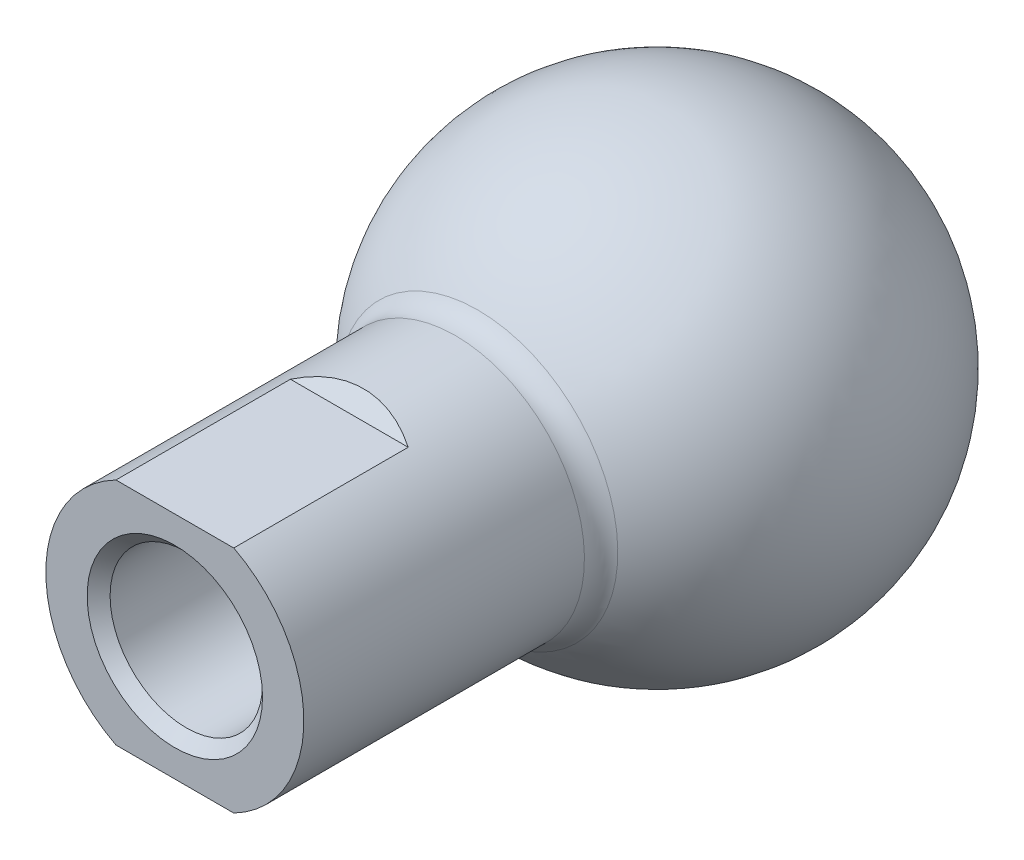
ISO-10303-21;
HEADER;
FILE_DESCRIPTION(('STEP AP214'),'2;1');
FILE_NAME('part.step','',(''),(''),'','','');
FILE_SCHEMA(('AUTOMOTIVE_DESIGN { 1 0 10303 214 1 1 1 1 }'));
ENDSEC;
DATA;
#1=APPLICATION_CONTEXT('core data for automotive mechanical design processes');
#2=APPLICATION_PROTOCOL_DEFINITION('international standard','automotive_design',2000,#1);
#3=PRODUCT_CONTEXT('',#1,'mechanical');
#4=PRODUCT('Part','Part','',(#3));
#5=PRODUCT_RELATED_PRODUCT_CATEGORY('part','',(#4));
#6=PRODUCT_DEFINITION_FORMATION('','',#4);
#7=PRODUCT_DEFINITION_CONTEXT('part definition',#1,'design');
#8=PRODUCT_DEFINITION('design','',#6,#7);
#9=PRODUCT_DEFINITION_SHAPE('','',#8);
#10=(LENGTH_UNIT() NAMED_UNIT(*) SI_UNIT(.MILLI.,.METRE.));
#11=(NAMED_UNIT(*) PLANE_ANGLE_UNIT() SI_UNIT($,.RADIAN.));
#12=(NAMED_UNIT(*) SI_UNIT($,.STERADIAN.) SOLID_ANGLE_UNIT());
#13=UNCERTAINTY_MEASURE_WITH_UNIT(LENGTH_MEASURE(1.E-05),#10,'distance_accuracy_value','');
#14=(GEOMETRIC_REPRESENTATION_CONTEXT(3) GLOBAL_UNCERTAINTY_ASSIGNED_CONTEXT((#13)) GLOBAL_UNIT_ASSIGNED_CONTEXT((#10,
#11,#12)) REPRESENTATION_CONTEXT('',''));
#15=CARTESIAN_POINT('',(0.,0.,0.));
#16=DIRECTION('',(0.,0.,1.));
#17=DIRECTION('',(1.,0.,0.));
#18=AXIS2_PLACEMENT_3D('',#15,#16,#17);
#19=CARTESIAN_POINT('',(0.,0.,-28.575));
#20=DIRECTION('',(0.,0.,1.));
#21=DIRECTION('',(1.,0.,0.));
#22=AXIS2_PLACEMENT_3D('',#19,#20,#21);
#23=PLANE('',#22);
#24=CARTESIAN_POINT('',(0.,0.,-28.5749999999894));
#25=DIRECTION('',(0.,0.,-1.));
#26=DIRECTION('',(-1.,0.,0.));
#27=AXIS2_PLACEMENT_3D('',#24,#25,#26);
#28=CIRCLE('',#27,2.57809999999381);
#29=CARTESIAN_POINT('',(-2.57809999999381,0.,-28.5749999999894));
#30=VERTEX_POINT('',#29);
#31=EDGE_CURVE('E136',#30,#30,#28,.T.);
#32=ORIENTED_EDGE('',*,*,#31,.F.);
#33=EDGE_LOOP('',(#32));
#34=FACE_BOUND('',#33,.T.);
#35=ADVANCED_FACE('F14',(#34),#23,.T.);
#36=CARTESIAN_POINT('',(0.,0.,-33.3502));
#37=DIRECTION('',(0.,0.,-1.));
#38=DIRECTION('',(-1.,0.,0.));
#39=AXIS2_PLACEMENT_3D('',#36,#37,#38);
#40=PLANE('',#39);
#41=DIRECTION('',(0.500000000000017,0.866025403784429,0.));
#42=VECTOR('',#41,1.);
#43=CARTESIAN_POINT('',(2.7422983085979,0.,-33.3502));
#44=LINE('',#43,#42);
#45=CARTESIAN_POINT('',(2.74229830859754,-2.06720328100224E-13,-33.3502));
#46=VERTEX_POINT('',#45);
#47=CARTESIAN_POINT('',(1.37114915429862,-2.3749000000001,-33.3502));
#48=VERTEX_POINT('',#47);
#49=EDGE_CURVE('E219',#46,#48,#44,.F.);
#50=ORIENTED_EDGE('',*,*,#49,.T.);
#51=DIRECTION('',(1.,0.,0.));
#52=VECTOR('',#51,1.);
#53=CARTESIAN_POINT('',(1.37114915429844,-2.3749,-33.3502));
#54=LINE('',#53,#52);
#55=CARTESIAN_POINT('',(-1.37114915429844,-2.3749,-33.3502));
#56=VERTEX_POINT('',#55);
#57=EDGE_CURVE('E138',#48,#56,#54,.F.);
#58=ORIENTED_EDGE('',*,*,#57,.T.);
#59=DIRECTION('',(0.500000000000017,-0.866025403784429,0.));
#60=VECTOR('',#59,1.);
#61=CARTESIAN_POINT('',(-1.37114915429844,-2.3749,-33.3502));
#62=LINE('',#61,#60);
#63=CARTESIAN_POINT('',(-2.74229830859754,2.06720328100224E-13,-33.3502));
#64=VERTEX_POINT('',#63);
#65=EDGE_CURVE('E146',#56,#64,#62,.F.);
#66=ORIENTED_EDGE('',*,*,#65,.T.);
#67=DIRECTION('',(-0.500000000000017,-0.866025403784429,0.));
#68=VECTOR('',#67,1.);
#69=CARTESIAN_POINT('',(-2.7422983085979,0.,-33.3502));
#70=LINE('',#69,#68);
#71=CARTESIAN_POINT('',(-1.3711491542988,2.37490000000021,-33.3502));
#72=VERTEX_POINT('',#71);
#73=EDGE_CURVE('E234',#64,#72,#70,.F.);
#74=ORIENTED_EDGE('',*,*,#73,.T.);
#75=DIRECTION('',(1.,0.,0.));
#76=VECTOR('',#75,1.);
#77=CARTESIAN_POINT('',(-1.37114915429844,2.3749,-33.3502));
#78=LINE('',#77,#76);
#79=CARTESIAN_POINT('',(1.37114915429844,2.3749,-33.3502));
#80=VERTEX_POINT('',#79);
#81=EDGE_CURVE('E229',#72,#80,#78,.T.);
#82=ORIENTED_EDGE('',*,*,#81,.T.);
#83=DIRECTION('',(-0.500000000000017,0.866025403784429,0.));
#84=VECTOR('',#83,1.);
#85=CARTESIAN_POINT('',(1.37114915429844,2.3749,-33.3502));
#86=LINE('',#85,#84);
#87=EDGE_CURVE('E224',#80,#46,#86,.F.);
#88=ORIENTED_EDGE('',*,*,#87,.T.);
#89=EDGE_LOOP('',(#50,#58,#66,#74,#82,#88));
#90=FACE_BOUND('',#89,.T.);
#91=ADVANCED_FACE('F239',(#90),#40,.T.);
#92=CARTESIAN_POINT('',(0.,0.,-30.2132999999003));
#93=DIRECTION('',(0.,0.,-1.));
#94=DIRECTION('',(-1.,0.,0.));
#95=AXIS2_PLACEMENT_3D('',#92,#93,#94);
#96=CONICAL_SURFACE('',#95,4.21639999990475,0.785398163397448);
#97=ORIENTED_EDGE('',*,*,#31,.T.);
#98=EDGE_LOOP('',(#97));
#99=FACE_BOUND('',#98,.T.);
#100=CARTESIAN_POINT('',(0.,3.11060286983338E-13,-30.2133));
#101=DIRECTION('',(0.,0.,-1.));
#102=DIRECTION('',(-1.,0.,0.));
#103=AXIS2_PLACEMENT_3D('',#100,#101,#102);
#104=CIRCLE('',#103,4.2164);
#105=CARTESIAN_POINT('',(-4.2164,3.11060286983338E-13,-30.2133));
#106=VERTEX_POINT('',#105);
#107=EDGE_CURVE('E150',#106,#106,#104,.F.);
#108=ORIENTED_EDGE('',*,*,#107,.T.);
#109=EDGE_LOOP('',(#108));
#110=FACE_BOUND('',#109,.T.);
#111=ADVANCED_FACE('F329',(#99,#110),#96,.T.);
#112=CARTESIAN_POINT('',(1.37114915429844,-2.3749,-38.1));
#113=DIRECTION('',(0.,-1.,0.));
#114=DIRECTION('',(0.,0.,-1.));
#115=AXIS2_PLACEMENT_3D('',#112,#113,#114);
#116=PLANE('',#115);
#117=ORIENTED_EDGE('',*,*,#57,.F.);
#118=DIRECTION('',(0.,0.,1.));
#119=VECTOR('',#118,1.);
#120=CARTESIAN_POINT('',(1.37114915429916,-2.37490000000041,-38.1));
#121=LINE('',#120,#119);
#122=CARTESIAN_POINT('',(1.37114915429862,-2.3749000000001,-38.1));
#123=VERTEX_POINT('',#122);
#124=EDGE_CURVE('E154',#48,#123,#121,.F.);
#125=ORIENTED_EDGE('',*,*,#124,.T.);
#126=DIRECTION('',(1.,0.,0.));
#127=VECTOR('',#126,1.);
#128=CARTESIAN_POINT('',(0.,-2.3749,-38.1));
#129=LINE('',#128,#127);
#130=CARTESIAN_POINT('',(-1.37114915429844,-2.3749,-38.1));
#131=VERTEX_POINT('',#130);
#132=EDGE_CURVE('E153',#123,#131,#129,.F.);
#133=ORIENTED_EDGE('',*,*,#132,.T.);
#134=DIRECTION('',(0.,0.,1.));
#135=VECTOR('',#134,1.);
#136=CARTESIAN_POINT('',(-1.37114915429844,-2.3749,-38.1));
#137=LINE('',#136,#135);
#138=EDGE_CURVE('E141',#131,#56,#137,.T.);
#139=ORIENTED_EDGE('',*,*,#138,.T.);
#140=EDGE_LOOP('',(#117,#125,#133,#139));
#141=FACE_BOUND('',#140,.T.);
#142=ADVANCED_FACE('F267',(#141),#116,.F.);
#143=CARTESIAN_POINT('',(-1.37114915429844,-2.3749,-38.1));
#144=DIRECTION('',(-0.866025403784429,-0.500000000000017,0.));
#145=DIRECTION('',(0.500000000000017,-0.866025403784429,0.));
#146=AXIS2_PLACEMENT_3D('',#143,#144,#145);
#147=PLANE('',#146);
#148=ORIENTED_EDGE('',*,*,#65,.F.);
#149=ORIENTED_EDGE('',*,*,#138,.F.);
#150=DIRECTION('',(-0.500000000000278,0.866025403784278,0.));
#151=VECTOR('',#150,1.);
#152=CARTESIAN_POINT('',(-1.37114915429844,-2.3749,-38.1));
#153=LINE('',#152,#151);
#154=CARTESIAN_POINT('',(-2.74229830859754,2.06720328100224E-13,-38.1));
#155=VERTEX_POINT('',#154);
#156=EDGE_CURVE('E215',#131,#155,#153,.T.);
#157=ORIENTED_EDGE('',*,*,#156,.T.);
#158=DIRECTION('',(0.,0.,1.));
#159=VECTOR('',#158,1.);
#160=CARTESIAN_POINT('',(-2.7422983085979,0.,-38.1));
#161=LINE('',#160,#159);
#162=EDGE_CURVE('E236',#155,#64,#161,.T.);
#163=ORIENTED_EDGE('',*,*,#162,.T.);
#164=EDGE_LOOP('',(#148,#149,#157,#163));
#165=FACE_BOUND('',#164,.T.);
#166=ADVANCED_FACE('F244',(#165),#147,.F.);
#167=CARTESIAN_POINT('',(-2.7422983085979,0.,-38.1));
#168=DIRECTION('',(-0.866025403784429,0.500000000000017,0.));
#169=DIRECTION('',(-0.500000000000017,-0.866025403784429,0.));
#170=AXIS2_PLACEMENT_3D('',#167,#168,#169);
#171=PLANE('',#170);
#172=ORIENTED_EDGE('',*,*,#73,.F.);
#173=ORIENTED_EDGE('',*,*,#162,.F.);
#174=DIRECTION('',(0.500000000000278,0.866025403784278,0.));
#175=VECTOR('',#174,1.);
#176=CARTESIAN_POINT('',(-2.7422983085979,0.,-38.1));
#177=LINE('',#176,#175);
#178=CARTESIAN_POINT('',(-1.3711491542988,2.37490000000021,-38.1));
#179=VERTEX_POINT('',#178);
#180=EDGE_CURVE('E213',#155,#179,#177,.T.);
#181=ORIENTED_EDGE('',*,*,#180,.T.);
#182=DIRECTION('',(0.,0.,1.));
#183=VECTOR('',#182,1.);
#184=CARTESIAN_POINT('',(-1.37114915429844,2.3749,-38.1));
#185=LINE('',#184,#183);
#186=EDGE_CURVE('E231',#179,#72,#185,.T.);
#187=ORIENTED_EDGE('',*,*,#186,.T.);
#188=EDGE_LOOP('',(#172,#173,#181,#187));
#189=FACE_BOUND('',#188,.T.);
#190=ADVANCED_FACE('F248',(#189),#171,.F.);
#191=CARTESIAN_POINT('',(-1.37114915429844,2.3749,-38.1));
#192=DIRECTION('',(0.,1.,0.));
#193=DIRECTION('',(0.,0.,1.));
#194=AXIS2_PLACEMENT_3D('',#191,#192,#193);
#195=PLANE('',#194);
#196=ORIENTED_EDGE('',*,*,#81,.F.);
#197=ORIENTED_EDGE('',*,*,#186,.F.);
#198=DIRECTION('',(1.,0.,0.));
#199=VECTOR('',#198,1.);
#200=CARTESIAN_POINT('',(0.,2.3749,-38.1));
#201=LINE('',#200,#199);
#202=CARTESIAN_POINT('',(1.37114915429844,2.3749,-38.1));
#203=VERTEX_POINT('',#202);
#204=EDGE_CURVE('E211',#179,#203,#201,.T.);
#205=ORIENTED_EDGE('',*,*,#204,.T.);
#206=DIRECTION('',(0.,0.,1.));
#207=VECTOR('',#206,1.);
#208=CARTESIAN_POINT('',(1.37114915429844,2.3749,-38.1));
#209=LINE('',#208,#207);
#210=EDGE_CURVE('E226',#203,#80,#209,.T.);
#211=ORIENTED_EDGE('',*,*,#210,.T.);
#212=EDGE_LOOP('',(#196,#197,#205,#211));
#213=FACE_BOUND('',#212,.T.);
#214=ADVANCED_FACE('F253',(#213),#195,.F.);
#215=CARTESIAN_POINT('',(1.37114915429844,2.3749,-38.1));
#216=DIRECTION('',(0.866025403784429,0.500000000000017,0.));
#217=DIRECTION('',(-0.500000000000017,0.866025403784429,0.));
#218=AXIS2_PLACEMENT_3D('',#215,#216,#217);
#219=PLANE('',#218);
#220=ORIENTED_EDGE('',*,*,#87,.F.);
#221=ORIENTED_EDGE('',*,*,#210,.F.);
#222=DIRECTION('',(0.500000000000278,-0.866025403784278,0.));
#223=VECTOR('',#222,1.);
#224=CARTESIAN_POINT('',(1.37114915429844,2.3749,-38.1));
#225=LINE('',#224,#223);
#226=CARTESIAN_POINT('',(2.74229830859754,-2.06720328100224E-13,-38.1));
#227=VERTEX_POINT('',#226);
#228=EDGE_CURVE('E209',#203,#227,#225,.T.);
#229=ORIENTED_EDGE('',*,*,#228,.T.);
#230=DIRECTION('',(0.,0.,1.));
#231=VECTOR('',#230,1.);
#232=CARTESIAN_POINT('',(2.7422983085979,0.,-38.1));
#233=LINE('',#232,#231);
#234=EDGE_CURVE('E221',#227,#46,#233,.T.);
#235=ORIENTED_EDGE('',*,*,#234,.T.);
#236=EDGE_LOOP('',(#220,#221,#229,#235));
#237=FACE_BOUND('',#236,.T.);
#238=ADVANCED_FACE('F259',(#237),#219,.F.);
#239=CARTESIAN_POINT('',(2.7422983085979,0.,-38.1));
#240=DIRECTION('',(0.866025403784429,-0.500000000000017,0.));
#241=DIRECTION('',(0.500000000000017,0.866025403784429,0.));
#242=AXIS2_PLACEMENT_3D('',#239,#240,#241);
#243=PLANE('',#242);
#244=ORIENTED_EDGE('',*,*,#49,.F.);
#245=ORIENTED_EDGE('',*,*,#234,.F.);
#246=DIRECTION('',(-0.500000000000278,-0.866025403784278,0.));
#247=VECTOR('',#246,1.);
#248=CARTESIAN_POINT('',(2.7422983085979,0.,-38.1));
#249=LINE('',#248,#247);
#250=EDGE_CURVE('E135',#227,#123,#249,.T.);
#251=ORIENTED_EDGE('',*,*,#250,.T.);
#252=ORIENTED_EDGE('',*,*,#124,.F.);
#253=EDGE_LOOP('',(#244,#245,#251,#252));
#254=FACE_BOUND('',#253,.T.);
#255=ADVANCED_FACE('F264',(#254),#243,.F.);
#256=CARTESIAN_POINT('',(0.,3.11060286983338E-13,0.));
#257=DIRECTION('',(0.,0.,-1.));
#258=DIRECTION('',(-1.,0.,0.));
#259=AXIS2_PLACEMENT_3D('',#256,#257,#258);
#260=CYLINDRICAL_SURFACE('',#259,4.2164);
#261=CARTESIAN_POINT('',(0.,3.13117587413814E-13,-0.634961470139129));
#262=DIRECTION('',(0.,0.,1.));
#263=DIRECTION('',(1.,0.,0.));
#264=AXIS2_PLACEMENT_3D('',#261,#262,#263);
#265=CIRCLE('',#264,4.2164);
#266=CARTESIAN_POINT('',(4.2164,3.13117587413814E-13,-0.634961470139129));
#267=VERTEX_POINT('',#266);
#268=EDGE_CURVE('E132',#267,#267,#265,.T.);
#269=ORIENTED_EDGE('',*,*,#268,.T.);
#270=EDGE_LOOP('',(#269));
#271=FACE_BOUND('',#270,.T.);
#272=ORIENTED_EDGE('',*,*,#107,.F.);
#273=EDGE_LOOP('',(#272));
#274=FACE_BOUND('',#273,.T.);
#275=ADVANCED_FACE('F273',(#271,#274),#260,.F.);
#276=CARTESIAN_POINT('',(0.,0.,-38.1));
#277=DIRECTION('',(0.,0.,1.));
#278=DIRECTION('',(1.,0.,0.));
#279=AXIS2_PLACEMENT_3D('',#276,#277,#278);
#280=PLANE('',#279);
#281=ORIENTED_EDGE('',*,*,#228,.F.);
#282=ORIENTED_EDGE('',*,*,#204,.F.);
#283=ORIENTED_EDGE('',*,*,#180,.F.);
#284=ORIENTED_EDGE('',*,*,#156,.F.);
#285=ORIENTED_EDGE('',*,*,#132,.F.);
#286=ORIENTED_EDGE('',*,*,#250,.F.);
#287=EDGE_LOOP('',(#281,#282,#283,#284,#285,#286));
#288=FACE_BOUND('',#287,.T.);
#289=CARTESIAN_POINT('',(0.,0.,-38.0999999999858));
#290=DIRECTION('',(0.,0.,1.));
#291=DIRECTION('',(1.,0.,0.));
#292=AXIS2_PLACEMENT_3D('',#289,#290,#291);
#293=CIRCLE('',#292,4.00050000001784);
#294=CARTESIAN_POINT('',(4.00050000001784,0.,-38.0999999999858));
#295=VERTEX_POINT('',#294);
#296=EDGE_CURVE('E129',#295,#295,#293,.T.);
#297=ORIENTED_EDGE('',*,*,#296,.F.);
#298=EDGE_LOOP('',(#297));
#299=FACE_BOUND('',#298,.T.);
#300=ADVANCED_FACE('F269',(#288,#299),#280,.F.);
#301=CARTESIAN_POINT('',(0.,3.13117587413814E-13,1.87033037946094E-05));
#302=DIRECTION('',(0.,0.,1.));
#303=DIRECTION('',(1.,0.,0.));
#304=AXIS2_PLACEMENT_3D('',#301,#302,#303);
#305=CONICAL_SURFACE('',#304,4.85137437095804,0.78539359434818);
#306=ORIENTED_EDGE('',*,*,#268,.F.);
#307=EDGE_LOOP('',(#306));
#308=FACE_BOUND('',#307,.T.);
#309=CARTESIAN_POINT('',(0.,3.13117587413814E-13,0.));
#310=DIRECTION('',(0.,0.,1.));
#311=DIRECTION('',(1.,0.,0.));
#312=AXIS2_PLACEMENT_3D('',#309,#310,#311);
#313=CIRCLE('',#312,4.85135566782516);
#314=CARTESIAN_POINT('',(4.85135566782516,3.13117587413814E-13,0.));
#315=VERTEX_POINT('',#314);
#316=EDGE_CURVE('E105',#315,#315,#313,.F.);
#317=ORIENTED_EDGE('',*,*,#316,.F.);
#318=EDGE_LOOP('',(#317));
#319=FACE_BOUND('',#318,.T.);
#320=ADVANCED_FACE('F272',(#308,#319),#305,.F.);
#321=CARTESIAN_POINT('',(0.,0.,-37.6745702222934));
#322=DIRECTION('',(0.,0.,1.));
#323=DIRECTION('',(1.,0.,0.));
#324=AXIS2_PLACEMENT_3D('',#321,#322,#323);
#325=CONICAL_SURFACE('',#324,4.42592977765344,0.785398163330641);
#326=ORIENTED_EDGE('',*,*,#296,.T.);
#327=EDGE_LOOP('',(#326));
#328=FACE_BOUND('',#327,.T.);
#329=CARTESIAN_POINT('',(0.,3.09980732084794E-13,-37.6745702223502));
#330=DIRECTION('',(0.,0.,-1.));
#331=DIRECTION('',(0.,-1.,0.));
#332=AXIS2_PLACEMENT_3D('',#329,#330,#331);
#333=CIRCLE('',#332,4.42592977771059);
#334=CARTESIAN_POINT('',(0.,-4.42592977771028,-37.6745702223502));
#335=VERTEX_POINT('',#334);
#336=EDGE_CURVE('E200',#335,#335,#333,.T.);
#337=ORIENTED_EDGE('',*,*,#336,.T.);
#338=EDGE_LOOP('',(#337));
#339=FACE_BOUND('',#338,.T.);
#340=ADVANCED_FACE('F277',(#328,#339),#325,.T.);
#341=CARTESIAN_POINT('',(-15.0876,6.35,-9.652));
#342=DIRECTION('',(0.,-0.707106781186548,-0.707106781186548));
#343=DIRECTION('',(0.,0.707106781186548,-0.707106781186548));
#344=AXIS2_PLACEMENT_3D('',#341,#342,#343);
#345=PLANE('',#344);
#346=DIRECTION('',(1.,0.,0.));
#347=VECTOR('',#346,1.);
#348=CARTESIAN_POINT('',(-15.0876,6.35,-9.652));
#349=LINE('',#348,#347);
#350=CARTESIAN_POINT('',(-3.25883088852507,6.34999999999991,-9.65199999999991));
#351=VERTEX_POINT('',#350);
#352=CARTESIAN_POINT('',(3.25883088852506,6.34999999999991,-9.65199999999991));
#353=VERTEX_POINT('',#352);
#354=EDGE_CURVE('E121',#351,#353,#349,.T.);
#355=ORIENTED_EDGE('',*,*,#354,.T.);
#356=CARTESIAN_POINT('',(0.,3.06161087463494E-13,-3.3020000000003));
#357=DIRECTION('',(0.,-0.707106781186548,-0.707106781186548));
#358=DIRECTION('',(0.,-0.707106781186548,0.707106781186548));
#359=AXIS2_PLACEMENT_3D('',#356,#357,#358);
#360=ELLIPSE('',#359,10.0938078800817,7.1374);
#361=EDGE_CURVE('E125',#351,#353,#360,.T.);
#362=ORIENTED_EDGE('',*,*,#361,.F.);
#363=EDGE_LOOP('',(#355,#362));
#364=FACE_BOUND('',#363,.T.);
#365=ADVANCED_FACE('F280',(#364),#345,.F.);
#366=CARTESIAN_POINT('',(-15.0876,-7.1374,-10.4394));
#367=DIRECTION('',(0.,0.707106781186798,-0.707106781186298));
#368=DIRECTION('',(0.,0.707106781186298,0.707106781186798));
#369=AXIS2_PLACEMENT_3D('',#366,#367,#368);
#370=PLANE('',#369);
#371=DIRECTION('',(1.,0.,0.));
#372=VECTOR('',#371,1.);
#373=CARTESIAN_POINT('',(-15.0876,-6.35,-9.652));
#374=LINE('',#373,#372);
#375=CARTESIAN_POINT('',(3.25883088852307,-6.35000000000018,-9.6519999999999));
#376=VERTEX_POINT('',#375);
#377=CARTESIAN_POINT('',(-3.25883088852307,-6.35000000000018,-9.6519999999999));
#378=VERTEX_POINT('',#377);
#379=EDGE_CURVE('E106',#376,#378,#374,.F.);
#380=ORIENTED_EDGE('',*,*,#379,.T.);
#381=CARTESIAN_POINT('',(0.,3.06161087463494E-13,-3.30199999999465));
#382=DIRECTION('',(0.,0.707106781186798,-0.707106781186298));
#383=DIRECTION('',(0.,0.707106781186298,0.707106781186798));
#384=AXIS2_PLACEMENT_3D('',#381,#382,#383);
#385=ELLIPSE('',#384,10.0938078800853,7.1374);
#386=EDGE_CURVE('E199',#376,#378,#385,.T.);
#387=ORIENTED_EDGE('',*,*,#386,.F.);
#388=EDGE_LOOP('',(#380,#387));
#389=FACE_BOUND('',#388,.T.);
#390=ADVANCED_FACE('F304',(#389),#370,.F.);
#391=CARTESIAN_POINT('',(-15.0876,-6.35,-9.652));
#392=DIRECTION('',(0.,1.,0.));
#393=DIRECTION('',(0.,0.,1.));
#394=AXIS2_PLACEMENT_3D('',#391,#392,#393);
#395=PLANE('',#394);
#396=DIRECTION('',(0.,0.,1.));
#397=VECTOR('',#396,1.);
#398=CARTESIAN_POINT('',(3.25883088852298,-6.35000000000036,-40.005));
#399=LINE('',#398,#397);
#400=CARTESIAN_POINT('',(3.25883088852334,-6.35000000000018,0.));
#401=VERTEX_POINT('',#400);
#402=EDGE_CURVE('E110',#401,#376,#399,.F.);
#403=ORIENTED_EDGE('',*,*,#402,.F.);
#404=DIRECTION('',(1.,0.,0.));
#405=VECTOR('',#404,1.);
#406=CARTESIAN_POINT('',(0.,-6.35,0.));
#407=LINE('',#406,#405);
#408=CARTESIAN_POINT('',(-3.25883088852334,-6.35000000000018,0.));
#409=VERTEX_POINT('',#408);
#410=EDGE_CURVE('E97',#409,#401,#407,.T.);
#411=ORIENTED_EDGE('',*,*,#410,.F.);
#412=DIRECTION('',(0.,0.,1.));
#413=VECTOR('',#412,1.);
#414=CARTESIAN_POINT('',(-3.25883088852299,-6.35000000000036,-40.005));
#415=LINE('',#414,#413);
#416=EDGE_CURVE('E197',#378,#409,#415,.T.);
#417=ORIENTED_EDGE('',*,*,#416,.F.);
#418=ORIENTED_EDGE('',*,*,#379,.F.);
#419=EDGE_LOOP('',(#403,#411,#417,#418));
#420=FACE_BOUND('',#419,.T.);
#421=ADVANCED_FACE('F111',(#420),#395,.F.);
#422=CARTESIAN_POINT('',(0.,3.11060286983338E-13,0.));
#423=DIRECTION('',(0.,0.,1.));
#424=DIRECTION('',(1.,0.,0.));
#425=AXIS2_PLACEMENT_3D('',#422,#423,#424);
#426=PLANE('',#425);
#427=ORIENTED_EDGE('',*,*,#316,.T.);
#428=EDGE_LOOP('',(#427));
#429=FACE_BOUND('',#428,.T.);
#430=CARTESIAN_POINT('',(0.,3.06161087463494E-13,0.));
#431=DIRECTION('',(0.,0.,1.));
#432=DIRECTION('',(1.,0.,0.));
#433=AXIS2_PLACEMENT_3D('',#430,#431,#432);
#434=CIRCLE('',#433,7.1374);
#435=CARTESIAN_POINT('',(3.25883088852507,6.34999999999991,0.));
#436=VERTEX_POINT('',#435);
#437=EDGE_CURVE('E94',#436,#401,#434,.F.);
#438=ORIENTED_EDGE('',*,*,#437,.F.);
#439=DIRECTION('',(1.,0.,0.));
#440=VECTOR('',#439,1.);
#441=CARTESIAN_POINT('',(-15.0876,6.35,0.));
#442=LINE('',#441,#440);
#443=CARTESIAN_POINT('',(-3.25883088852507,6.34999999999991,0.));
#444=VERTEX_POINT('',#443);
#445=EDGE_CURVE('E119',#436,#444,#442,.F.);
#446=ORIENTED_EDGE('',*,*,#445,.T.);
#447=CARTESIAN_POINT('',(0.,3.06161087463494E-13,0.));
#448=DIRECTION('',(0.,0.,1.));
#449=DIRECTION('',(1.,0.,0.));
#450=AXIS2_PLACEMENT_3D('',#447,#448,#449);
#451=CIRCLE('',#450,7.1374);
#452=EDGE_CURVE('E101',#409,#444,#451,.F.);
#453=ORIENTED_EDGE('',*,*,#452,.F.);
#454=ORIENTED_EDGE('',*,*,#410,.T.);
#455=EDGE_LOOP('',(#438,#446,#453,#454));
#456=FACE_BOUND('',#455,.T.);
#457=ADVANCED_FACE('F99',(#429,#456),#426,.T.);
#458=CARTESIAN_POINT('',(-15.0876,6.35,0.));
#459=DIRECTION('',(0.,-1.,0.));
#460=DIRECTION('',(0.,0.,-1.));
#461=AXIS2_PLACEMENT_3D('',#458,#459,#460);
#462=PLANE('',#461);
#463=DIRECTION('',(0.,0.,1.));
#464=VECTOR('',#463,1.);
#465=CARTESIAN_POINT('',(3.25883088852525,6.34999999999981,-40.005));
#466=LINE('',#465,#464);
#467=EDGE_CURVE('E114',#353,#436,#466,.T.);
#468=ORIENTED_EDGE('',*,*,#467,.F.);
#469=ORIENTED_EDGE('',*,*,#354,.F.);
#470=DIRECTION('',(0.,0.,1.));
#471=VECTOR('',#470,1.);
#472=CARTESIAN_POINT('',(-3.25883088852525,6.34999999999981,-40.005));
#473=LINE('',#472,#471);
#474=EDGE_CURVE('E194',#444,#351,#473,.F.);
#475=ORIENTED_EDGE('',*,*,#474,.F.);
#476=ORIENTED_EDGE('',*,*,#445,.F.);
#477=EDGE_LOOP('',(#468,#469,#475,#476));
#478=FACE_BOUND('',#477,.T.);
#479=ADVANCED_FACE('F286',(#478),#462,.F.);
#480=CARTESIAN_POINT('',(0.,3.10081821330854E-13,-38.1000187034033));
#481=DIRECTION('',(0.,0.,-1.));
#482=DIRECTION('',(-1.,0.,0.));
#483=AXIS2_PLACEMENT_3D('',#480,#481,#482);
#484=CONICAL_SURFACE('',#483,4.85137437101488,0.785393594375903);
#485=CARTESIAN_POINT('',(0.,3.10081821330854E-13,-38.1));
#486=DIRECTION('',(0.,0.,1.));
#487=DIRECTION('',(1.,0.,0.));
#488=AXIS2_PLACEMENT_3D('',#485,#486,#487);
#489=CIRCLE('',#488,4.8513556677825);
#490=CARTESIAN_POINT('',(4.8513556677825,3.10081821330854E-13,-38.1));
#491=VERTEX_POINT('',#490);
#492=EDGE_CURVE('E165',#491,#491,#489,.F.);
#493=ORIENTED_EDGE('',*,*,#492,.T.);
#494=EDGE_LOOP('',(#493));
#495=FACE_BOUND('',#494,.T.);
#496=ORIENTED_EDGE('',*,*,#336,.F.);
#497=EDGE_LOOP('',(#496));
#498=FACE_BOUND('',#497,.T.);
#499=ADVANCED_FACE('F284',(#495,#498),#484,.F.);
#500=CARTESIAN_POINT('',(0.,3.06161087463494E-13,-40.005));
#501=DIRECTION('',(0.,0.,1.));
#502=DIRECTION('',(1.,0.,0.));
#503=AXIS2_PLACEMENT_3D('',#500,#501,#502);
#504=CYLINDRICAL_SURFACE('',#503,7.1374);
#505=CARTESIAN_POINT('',(0.,3.09159279880356E-13,-15.5229010051951));
#506=DIRECTION('',(0.,0.,1.));
#507=DIRECTION('',(0.,1.,0.));
#508=AXIS2_PLACEMENT_3D('',#505,#506,#507);
#509=CIRCLE('',#508,7.1374);
#510=CARTESIAN_POINT('',(0.,7.13740000000031,-15.5229010051951));
#511=VERTEX_POINT('',#510);
#512=EDGE_CURVE('E159',#511,#511,#509,.T.);
#513=ORIENTED_EDGE('',*,*,#512,.T.);
#514=EDGE_LOOP('',(#513));
#515=FACE_BOUND('',#514,.T.);
#516=ORIENTED_EDGE('',*,*,#452,.T.);
#517=ORIENTED_EDGE('',*,*,#474,.T.);
#518=ORIENTED_EDGE('',*,*,#361,.T.);
#519=ORIENTED_EDGE('',*,*,#467,.T.);
#520=ORIENTED_EDGE('',*,*,#437,.T.);
#521=ORIENTED_EDGE('',*,*,#402,.T.);
#522=ORIENTED_EDGE('',*,*,#386,.T.);
#523=ORIENTED_EDGE('',*,*,#416,.T.);
#524=EDGE_LOOP('',(#516,#517,#518,#519,#520,#521,#522,#523));
#525=FACE_BOUND('',#524,.T.);
#526=ADVANCED_FACE('F117',(#515,#525),#504,.T.);
#527=CARTESIAN_POINT('',(0.,3.0639438267864E-13,-38.1));
#528=DIRECTION('',(0.,0.,1.));
#529=DIRECTION('',(1.,0.,0.));
#530=AXIS2_PLACEMENT_3D('',#527,#528,#529);
#531=PLANE('',#530);
#532=ORIENTED_EDGE('',*,*,#492,.F.);
#533=EDGE_LOOP('',(#532));
#534=FACE_BOUND('',#533,.T.);
#535=CARTESIAN_POINT('',(0.,5.23788401933484,-38.1));
#536=CARTESIAN_POINT('',(-0.147063357228258,5.23788313808109,-38.1));
#537=CARTESIAN_POINT('',(-0.294153741265883,5.23168486532427,-38.1));
#538=CARTESIAN_POINT('',(-0.587318025154742,5.20693207047287,-38.1));
#539=CARTESIAN_POINT('',(-0.733391612039123,5.1883739004264,-38.1));
#540=CARTESIAN_POINT('',(-1.02370203894374,5.13898480915842,-38.1));
#541=CARTESIAN_POINT('',(-1.16793558645241,5.10813440634412,-38.1));
#542=CARTESIAN_POINT('',(-1.45337126731623,5.03437349063667,-38.1));
#543=CARTESIAN_POINT('',(-1.59457084015081,4.99145319088609,-38.1));
#544=CARTESIAN_POINT('',(-2.01150146465137,4.84518093220889,-38.1));
#545=CARTESIAN_POINT('',(-2.28126608151166,4.72419746772514,-38.1));
#546=CARTESIAN_POINT('',(-2.79662513923981,4.43859341444432,-38.1));
#547=CARTESIAN_POINT('',(-3.0422186608099,4.2739711668149,-38.1));
#548=CARTESIAN_POINT('',(-3.38714401333737,3.9980583886851,-38.1));
#549=CARTESIAN_POINT('',(-3.49827328468623,3.90118471610941,-38.1));
#550=CARTESIAN_POINT('',(-3.71190036578885,3.69849369843932,-38.1));
#551=CARTESIAN_POINT('',(-3.81440639426735,3.59268506644474,-38.1));
#552=CARTESIAN_POINT('',(-4.01018154387314,3.37276822905015,-38.1));
#553=CARTESIAN_POINT('',(-4.10344645972448,3.25865628572507,-38.1));
#554=CARTESIAN_POINT('',(-4.28005516153007,3.02295310727306,-38.1));
#555=CARTESIAN_POINT('',(-4.36339664463531,2.90136014597892,-38.1));
#556=CARTESIAN_POINT('',(-4.51951139108627,2.651626512692,-38.1));
#557=CARTESIAN_POINT('',(-4.5922882141956,2.52348806596749,-38.1));
#558=CARTESIAN_POINT('',(-4.7268153828553,2.26149094702573,-38.1));
#559=CARTESIAN_POINT('',(-4.78856165540755,2.12763018437737,-38.1));
#560=CARTESIAN_POINT('',(-4.90053465623809,1.85522415320293,-38.1));
#561=CARTESIAN_POINT('',(-4.95076577489007,1.71668069324016,-38.1));
#562=CARTESIAN_POINT('',(-5.03939582330322,1.43584008674493,-38.1));
#563=CARTESIAN_POINT('',(-5.07779031833967,1.29354155495615,-38.1));
#564=CARTESIAN_POINT('',(-5.17472263589275,0.862650665948947,-38.1));
#565=CARTESIAN_POINT('',(-5.21513040378072,0.569767534392856,-38.1));
#566=CARTESIAN_POINT('',(-5.24612936793519,-0.0186232804273015,-38.1));
#567=CARTESIAN_POINT('',(-5.23672056420168,-0.314130963691368,-38.1));
#568=CARTESIAN_POINT('',(-5.18560156174193,-0.752821834354461,-38.1));
#569=CARTESIAN_POINT('',(-5.16237191288471,-0.898366991650458,-38.1));
#570=CARTESIAN_POINT('',(-5.10374239072403,-1.18696586702862,-38.1));
#571=CARTESIAN_POINT('',(-5.06834707315361,-1.33002049671103,-38.1));
#572=CARTESIAN_POINT('',(-4.98561754342475,-1.61268429638486,-38.1));
#573=CARTESIAN_POINT('',(-4.93827877515899,-1.75229212915214,-38.1));
#574=CARTESIAN_POINT('',(-4.83202619848161,-2.02697456286569,-38.1));
#575=CARTESIAN_POINT('',(-4.77311666017652,-2.16205081469235,-38.1));
#576=CARTESIAN_POINT('',(-4.64410740268948,-2.42680600942284,-38.1));
#577=CARTESIAN_POINT('',(-4.57400390962601,-2.55648311342643,-38.1));
#578=CARTESIAN_POINT('',(-4.42313987181513,-2.8094389672453,-38.1));
#579=CARTESIAN_POINT('',(-4.34238179854879,-2.9327191916955,-38.1));
#580=CARTESIAN_POINT('',(-4.17079863581487,-3.17199004833925,-38.1));
#581=CARTESIAN_POINT('',(-4.07997812111306,-3.28798395588743,-38.1));
#582=CARTESIAN_POINT('',(-3.88883181666978,-3.5120001801263,-38.1));
#583=CARTESIAN_POINT('',(-3.7884969381556,-3.62001469555074,-38.1));
#584=CARTESIAN_POINT('',(-3.47447313770296,-3.93064375520353,-38.1));
#585=CARTESIAN_POINT('',(-3.24753720523844,-4.12016089112591,-38.1));
#586=CARTESIAN_POINT('',(-2.76504153457195,-4.45833623236322,-38.1));
#587=CARTESIAN_POINT('',(-2.50948288488367,-4.60699599073034,-38.1));
#588=CARTESIAN_POINT('',(-2.11023019468167,-4.79626830426676,-38.1));
#589=CARTESIAN_POINT('',(-1.97432222443116,-4.85378782375133,-38.1));
#590=CARTESIAN_POINT('',(-1.69821726220484,-4.95713312083928,-38.1));
#591=CARTESIAN_POINT('',(-1.55802384494807,-5.00296836206922,-38.1));
#592=CARTESIAN_POINT('',(-1.27451020548585,-5.08258897839884,-38.1));
#593=CARTESIAN_POINT('',(-1.13119530463158,-5.11639338127589,-38.1));
#594=CARTESIAN_POINT('',(-0.842254899622735,-5.17181396007425,-38.1));
#595=CARTESIAN_POINT('',(-0.696630090018165,-5.19343373086712,-38.1));
#596=CARTESIAN_POINT('',(-0.458982978351296,-5.21854541599926,-38.1));
#597=CARTESIAN_POINT('',(-0.367341166148053,-5.22579509733965,-38.1));
#598=CARTESIAN_POINT('',(-0.183803087816887,-5.23546467437563,-38.1));
#599=CARTESIAN_POINT('',(-0.0919068216889633,-5.23788457007121,-38.1));
#600=CARTESIAN_POINT('',(0.147063357228262,-5.23788313808048,-38.1));
#601=CARTESIAN_POINT('',(0.294153741265887,-5.23168486532366,-38.1));
#602=CARTESIAN_POINT('',(0.587318025154747,-5.20693207047225,-38.1));
#603=CARTESIAN_POINT('',(0.733391612039128,-5.18837390042577,-38.1));
#604=CARTESIAN_POINT('',(1.02370203894375,-5.13898480915779,-38.1));
#605=CARTESIAN_POINT('',(1.16793558645241,-5.10813440634351,-38.1));
#606=CARTESIAN_POINT('',(1.45337126731624,-5.03437349063606,-38.1));
#607=CARTESIAN_POINT('',(1.59457084015082,-4.99145319088548,-38.1));
#608=CARTESIAN_POINT('',(2.01150146465139,-4.84518093220828,-38.1));
#609=CARTESIAN_POINT('',(2.28126608151167,-4.72419746772453,-38.1));
#610=CARTESIAN_POINT('',(2.79662513923982,-4.4385934144437,-38.1));
#611=CARTESIAN_POINT('',(3.04221866080991,-4.27397116681428,-38.1));
#612=CARTESIAN_POINT('',(3.38714401333737,-3.99805838868448,-38.1));
#613=CARTESIAN_POINT('',(3.49827328468623,-3.90118471610878,-38.1));
#614=CARTESIAN_POINT('',(3.71190036578885,-3.69849369843869,-38.1));
#615=CARTESIAN_POINT('',(3.81440639426735,-3.59268506644411,-38.1));
#616=CARTESIAN_POINT('',(4.01018154387314,-3.37276822904952,-38.1));
#617=CARTESIAN_POINT('',(4.10344645972448,-3.25865628572445,-38.1));
#618=CARTESIAN_POINT('',(4.28005516153007,-3.02295310727243,-38.1));
#619=CARTESIAN_POINT('',(4.36339664463531,-2.9013601459783,-38.1));
#620=CARTESIAN_POINT('',(4.51951139108628,-2.65162651269137,-38.1));
#621=CARTESIAN_POINT('',(4.59228821419561,-2.52348806596686,-38.1));
#622=CARTESIAN_POINT('',(4.72681538285531,-2.2614909470251,-38.1));
#623=CARTESIAN_POINT('',(4.78856165540756,-2.12763018437674,-38.1));
#624=CARTESIAN_POINT('',(4.9005346562381,-1.8552241532023,-38.1));
#625=CARTESIAN_POINT('',(4.95076577489007,-1.71668069323953,-38.1));
#626=CARTESIAN_POINT('',(5.03939582330322,-1.4358400867443,-38.1));
#627=CARTESIAN_POINT('',(5.07779031833968,-1.29354155495552,-38.1));
#628=CARTESIAN_POINT('',(5.17472263589277,-0.862650665948328,-38.1));
#629=CARTESIAN_POINT('',(5.21513040378074,-0.569767534392235,-38.1));
#630=CARTESIAN_POINT('',(5.24612936793519,0.0186232804279246,-38.1));
#631=CARTESIAN_POINT('',(5.23672056420167,0.314130963691991,-38.1));
#632=CARTESIAN_POINT('',(5.18560156174194,0.752821834355087,-38.1));
#633=CARTESIAN_POINT('',(5.16237191288472,0.898366991651086,-38.1));
#634=CARTESIAN_POINT('',(5.10374239072403,1.18696586702924,-38.1));
#635=CARTESIAN_POINT('',(5.0683470731536,1.33002049671166,-38.1));
#636=CARTESIAN_POINT('',(4.98561754342473,1.61268429638548,-38.1));
#637=CARTESIAN_POINT('',(4.93827877515899,1.75229212915277,-38.1));
#638=CARTESIAN_POINT('',(4.83202619848162,2.02697456286632,-38.1));
#639=CARTESIAN_POINT('',(4.77311666017653,2.16205081469297,-38.1));
#640=CARTESIAN_POINT('',(4.64410740268949,2.42680600942347,-38.1));
#641=CARTESIAN_POINT('',(4.57400390962601,2.55648311342705,-38.1));
#642=CARTESIAN_POINT('',(4.42313987181513,2.80943896724593,-38.1));
#643=CARTESIAN_POINT('',(4.34238179854878,2.93271919169612,-38.1));
#644=CARTESIAN_POINT('',(4.17079863581486,3.17199004833987,-38.1));
#645=CARTESIAN_POINT('',(4.07997812111305,3.28798395588806,-38.1));
#646=CARTESIAN_POINT('',(3.88883181666978,3.51200018012693,-38.1));
#647=CARTESIAN_POINT('',(3.78849693815559,3.62001469555136,-38.1));
#648=CARTESIAN_POINT('',(3.47447313770295,3.93064375520416,-38.1));
#649=CARTESIAN_POINT('',(3.24753720523843,4.12016089112653,-38.1));
#650=CARTESIAN_POINT('',(2.76504153457195,4.45833623236384,-38.1));
#651=CARTESIAN_POINT('',(2.50948288488366,4.60699599073096,-38.1));
#652=CARTESIAN_POINT('',(2.11023019468166,4.79626830426737,-38.1));
#653=CARTESIAN_POINT('',(1.97432222443116,4.85378782375195,-38.1));
#654=CARTESIAN_POINT('',(1.69821726220483,4.9571331208399,-38.1));
#655=CARTESIAN_POINT('',(1.55802384494806,5.00296836206983,-38.1));
#656=CARTESIAN_POINT('',(1.27451020548584,5.08258897839945,-38.1));
#657=CARTESIAN_POINT('',(1.13119530463157,5.1163933812765,-38.1));
#658=CARTESIAN_POINT('',(0.84225489962272,5.17181396007487,-38.1));
#659=CARTESIAN_POINT('',(0.696630090018149,5.19343373086774,-38.1));
#660=CARTESIAN_POINT('',(0.458982978351282,5.21854541599988,-38.1));
#661=CARTESIAN_POINT('',(0.367341166148043,5.22579509734027,-38.1));
#662=CARTESIAN_POINT('',(0.183803087816884,5.23546467437625,-38.1));
#663=CARTESIAN_POINT('',(0.0919068216889634,5.23788457007183,-38.1));
#664=CARTESIAN_POINT('',(0.,5.23788401933484,-38.1));
#665=B_SPLINE_CURVE_WITH_KNOTS('',3,(#535,#536,#537,#538,#539,#540,#541,#542,#543,#544,#545,
#546,#547,#548,#549,#550,#551,#552,#553,#554,#555,#556,#557,#558,#559,#560,#561,#562,#563,#564,
#565,#566,#567,#568,#569,#570,#571,#572,#573,#574,#575,#576,#577,#578,#579,#580,#581,#582,#583,
#584,#585,#586,#587,#588,#589,#590,#591,#592,#593,#594,#595,#596,#597,#598,#599,#600,#601,#602,
#603,#604,#605,#606,#607,#608,#609,#610,#611,#612,#613,#614,#615,#616,#617,#618,#619,#620,#621,
#622,#623,#624,#625,#626,#627,#628,#629,#630,#631,#632,#633,#634,#635,#636,#637,#638,#639,#640,
#641,#642,#643,#644,#645,#646,#647,#648,#649,#650,#651,#652,#653,#654,#655,#656,#657,#658,#659,
#660,#661,#662,#663,#664),.UNSPECIFIED.,.T.,.F.,(4,2,2,2,2,2,2,2,2,2,2,2,2,2,2,2,2,2,2,2,2,2,2,
2,2,2,2,2,2,2,2,2,2,2,2,2,2,2,2,2,2,2,2,2,2,2,2,2,2,2,2,2,2,2,2,2,2,2,2,2,2,2,2,2,4),(0.,
0.441105462810769,0.882341173064662,1.32427898404251,1.76657617800595,2.64906218746336,
3.53158174749668,3.97341974267146,4.41483173947125,4.85644369220401,5.29815792726111,
5.73972297944685,6.18145074272018,6.62300980764772,7.06473410717637,7.94723689192287,
8.82973967666937,9.27146397619802,9.71302304112555,10.1547508043989,10.5963158565846,
11.0380300916417,11.4796420443745,11.9210540411743,12.3628920363491,13.2454115963824,
14.1278976058398,14.5701947998032,15.0121326107811,15.453368321035,15.8944737838457,
16.1701413728404,16.4458089618351,16.8869144246459,17.3281501348998,17.7700879458776,
18.2123851398411,19.0948711492985,19.9773907093318,20.4192287045066,20.8606407013064,
21.3022526540391,21.7439668890962,22.185531941282,22.6272597045553,23.0688187694828,
23.5105430690115,24.393045853758,25.2755486385045,25.7172729380331,26.1588320029607,
26.600559766234,27.0421248184197,27.4838390534768,27.9254510062096,28.3668630030094,
28.8087009981842,29.6912205582175,30.5737065676749,31.0160037616383,31.4579415726162,
31.8991772828701,32.3402827456808,32.6159503346755,32.8916179236702),.UNSPECIFIED.);
#666=CARTESIAN_POINT('',(0.,5.23788401933427,-38.1000000000002));
#667=VERTEX_POINT('',#666);
#668=EDGE_CURVE('E157',#667,#667,#665,.T.);
#669=ORIENTED_EDGE('',*,*,#668,.F.);
#670=EDGE_LOOP('',(#669));
#671=FACE_BOUND('',#670,.T.);
#672=ADVANCED_FACE('F167',(#534,#671),#531,.F.);
#673=CARTESIAN_POINT('',(0.,3.09159279880356E-13,-15.5229010051951));
#674=DIRECTION('',(0.,0.,1.));
#675=DIRECTION('',(0.,1.,0.));
#676=AXIS2_PLACEMENT_3D('',#673,#674,#675);
#677=TOROIDAL_SURFACE('',#676,8.7122,1.5748);
#678=ORIENTED_EDGE('',*,*,#512,.F.);
#679=EDGE_LOOP('',(#678));
#680=FACE_BOUND('',#679,.T.);
#681=CARTESIAN_POINT('',(0.,3.09159279880356E-13,-16.7636911985119));
#682=DIRECTION('',(0.,0.,1.));
#683=DIRECTION('',(0.,1.,0.));
#684=AXIS2_PLACEMENT_3D('',#681,#682,#683);
#685=CIRCLE('',#684,7.74243985637234);
#686=CARTESIAN_POINT('',(0.,7.74243985637265,-16.7636911985119));
#687=VERTEX_POINT('',#686);
#688=EDGE_CURVE('E25',#687,#687,#685,.F.);
#689=ORIENTED_EDGE('',*,*,#688,.F.);
#690=EDGE_LOOP('',(#689));
#691=FACE_BOUND('',#690,.T.);
#692=ADVANCED_FACE('F175',(#680,#691),#677,.F.);
#693=CARTESIAN_POINT('',(0.,3.07794153970024E-13,-26.67));
#694=DIRECTION('',(0.,1.,0.));
#695=DIRECTION('',(-1.,0.,0.));
#696=AXIS2_PLACEMENT_3D('',#693,#694,#695);
#697=SPHERICAL_SURFACE('',#696,12.573);
#698=CARTESIAN_POINT('',(0.,-12.5729999999997,-26.67));
#699=VERTEX_POINT('',#698);
#700=VERTEX_LOOP('',#699);
#701=FACE_BOUND('',#700,.T.);
#702=ORIENTED_EDGE('',*,*,#688,.T.);
#703=EDGE_LOOP('',(#702));
#704=FACE_BOUND('',#703,.T.);
#705=ORIENTED_EDGE('',*,*,#668,.T.);
#706=CARTESIAN_POINT('',(0.,12.5730000000003,-26.67));
#707=CARTESIAN_POINT('',(0.,12.5730012160098,-26.8194480453114));
#708=CARTESIAN_POINT('',(0.,12.5703354400636,-26.9688960154857));
#709=CARTESIAN_POINT('',(0.,12.5596786336099,-27.2676019806107));
#710=CARTESIAN_POINT('',(0.,12.5516876031025,-27.4168599755614));
#711=CARTESIAN_POINT('',(0.,12.5303890168771,-27.7149961652898));
#712=CARTESIAN_POINT('',(0.,12.517081461159,-27.8638743600674));
#713=CARTESIAN_POINT('',(0.,12.48516712778,-28.1610616721181));
#714=CARTESIAN_POINT('',(0.,12.466560350119,-28.3093707893911));
#715=CARTESIAN_POINT('',(0.,12.4240711276907,-28.6052313753118));
#716=CARTESIAN_POINT('',(0.,12.4001886829233,-28.7527828439596));
#717=CARTESIAN_POINT('',(0.,12.3471785191153,-29.0469405294674));
#718=CARTESIAN_POINT('',(0.,12.3180508000747,-29.1935467463275));
#719=CARTESIAN_POINT('',(0.,12.2545871147491,-29.4856275256918));
#720=CARTESIAN_POINT('',(0.,12.2202511484643,-29.631102088196));
#721=CARTESIAN_POINT('',(0.,12.1464146270513,-29.9207345954546));
#722=CARTESIAN_POINT('',(0.,12.1069140719232,-30.064892540209));
#723=CARTESIAN_POINT('',(0.,12.0227985952294,-30.3517085224967));
#724=CARTESIAN_POINT('',(0.,11.9781836736636,-30.49436656003));
#725=CARTESIAN_POINT('',(0.,11.883896189827,-30.7780013454836));
#726=CARTESIAN_POINT('',(0.,11.8342236275561,-30.9189780934039));
#727=CARTESIAN_POINT('',(0.,11.7298840183929,-31.1990710549068));
#728=CARTESIAN_POINT('',(0.,11.6752169715006,-31.3381872684894));
#729=CARTESIAN_POINT('',(0.,11.5609578994587,-31.6143822821681));
#730=CARTESIAN_POINT('',(0.,11.5013658743089,-31.7514610822643));
#731=CARTESIAN_POINT('',(0.,11.3773326139607,-32.0234069802881));
#732=CARTESIAN_POINT('',(0.,11.3128913787623,-32.1582740782157));
#733=CARTESIAN_POINT('',(0.,11.1792416320516,-32.4256250952865));
#734=CARTESIAN_POINT('',(0.,11.1100331205392,-32.5581090144298));
#735=CARTESIAN_POINT('',(0.,10.9669368162825,-32.8205252274058));
#736=CARTESIAN_POINT('',(0.,10.8930490235381,-32.9504575212387));
#737=CARTESIAN_POINT('',(0.,10.740688101366,-33.2076052813291));
#738=CARTESIAN_POINT('',(0.,10.6622149719383,-33.3348207475867));
#739=CARTESIAN_POINT('',(0.,10.5007831509695,-33.5863731045689));
#740=CARTESIAN_POINT('',(0.,10.4178244594282,-33.7107099952935));
#741=CARTESIAN_POINT('',(0.,10.2475269919648,-33.9563471132138));
#742=CARTESIAN_POINT('',(0.,10.1601882160426,-34.0776473404095));
#743=CARTESIAN_POINT('',(0.,9.98124162660302,-34.317056904238));
#744=CARTESIAN_POINT('',(0.,9.88963381308558,-34.4351662408709));
#745=CARTESIAN_POINT('',(0.,9.70226562310424,-34.6680438535943));
#746=CARTESIAN_POINT('',(0.,9.60650524664033,-34.7828121296849));
#747=CARTESIAN_POINT('',(0.,9.41095368518575,-35.0088616993311));
#748=CARTESIAN_POINT('',(0.,9.31116250019508,-35.1201429928868));
#749=CARTESIAN_POINT('',(0.,9.1076762010751,-35.3390771089933));
#750=CARTESIAN_POINT('',(0.,9.00398108694579,-35.4467299315442));
#751=CARTESIAN_POINT('',(0.,8.79281877257703,-35.6582702305754));
#752=CARTESIAN_POINT('',(0.,8.68535157233758,-35.7621577070556));
#753=CARTESIAN_POINT('',(0.,8.46678172481324,-35.9660352263675));
#754=CARTESIAN_POINT('',(0.,8.35567907752834,-36.066025269199));
#755=CARTESIAN_POINT('',(0.,8.12997959718194,-36.2619807888622));
#756=CARTESIAN_POINT('',(0.,8.01538276412043,-36.3579462656938));
#757=CARTESIAN_POINT('',(0.,7.78284061646963,-36.5457306386358));
#758=CARTESIAN_POINT('',(0.,7.66489530188032,-36.6375495347462));
#759=CARTESIAN_POINT('',(0.,7.42580615172051,-36.8169240014493));
#760=CARTESIAN_POINT('',(0.,7.30466231614999,-36.9044795720419));
#761=CARTESIAN_POINT('',(0.,7.05933015552943,-37.0752160718758));
#762=CARTESIAN_POINT('',(0.,6.93514183047938,-37.158397001117));
#763=CARTESIAN_POINT('',(0.,6.68387857764209,-37.3202784333369));
#764=CARTESIAN_POINT('',(0.,6.55680364985486,-37.3989789363156));
#765=CARTESIAN_POINT('',(0.,6.29992880694184,-37.5517995442104));
#766=CARTESIAN_POINT('',(0.,6.17012889181606,-37.6259196491265));
#767=CARTESIAN_POINT('',(0.,5.90796893602425,-37.7694848781347));
#768=CARTESIAN_POINT('',(0.,5.77560889535822,-37.8389300022268));
#769=CARTESIAN_POINT('',(0.,5.50849761999368,-37.9730582531592));
#770=CARTESIAN_POINT('',(0.,5.37374638529517,-38.0377413799996));
#771=CARTESIAN_POINT('',(0.,5.23788401933431,-38.1000000000002));
#772=B_SPLINE_CURVE_WITH_KNOTS('',3,(#706,#707,#708,#709,#710,#711,#712,#713,#714,#715,#716,
#717,#718,#719,#720,#721,#722,#723,#724,#725,#726,#727,#728,#729,#730,#731,#732,#733,#734,#735,
#736,#737,#738,#739,#740,#741,#742,#743,#744,#745,#746,#747,#748,#749,#750,#751,#752,#753,#754,
#755,#756,#757,#758,#759,#760,#761,#762,#763,#764,#765,#766,#767,#768,#769,#770,#771),
.UNSPECIFIED.,.F.,.F.,(4,2,2,2,2,2,2,2,2,2,2,2,2,2,2,2,2,2,2,2,2,2,2,2,2,2,2,2,2,2,2,2,4),(0.,
0.448320255745102,0.896640511490206,1.34496076723531,1.79328102298041,2.24160127872552,
2.68992153447062,3.13824179021572,3.58656204596082,4.03488230170593,4.48320255745103,
4.93152281319613,5.37984306894124,5.82816332468634,6.27648358043145,6.72480383617655,
7.17312409192165,7.62144434766676,8.06976460341185,8.51808485915696,8.96640511490206,
9.41472537064717,9.86304562639227,10.3113658821374,10.7596861378825,11.2080063936276,
11.6563266493727,12.1046469051178,12.5529671608629,13.001287416608,13.4496076723531,
13.8979279280982,14.3462481838433),.UNSPECIFIED.);
#773=CARTESIAN_POINT('',(0.,12.5730000000003,-26.67));
#774=VERTEX_POINT('',#773);
#775=EDGE_CURVE('E9',#774,#667,#772,.T.);
#776=ORIENTED_EDGE('',*,*,#775,.F.);
#777=ORIENTED_EDGE('',*,*,#775,.T.);
#778=EDGE_LOOP('',(#705,#776,#777));
#779=FACE_BOUND('',#778,.T.);
#780=ADVANCED_FACE('F171',(#701,#704,#779),#697,.T.);
#781=CLOSED_SHELL('',(#35,#91,#111,#142,#166,#190,#214,#238,#255,#275,#300,#320,#340,#365,#390,
#421,#457,#479,#499,#526,#672,#692,#780));
#782=MANIFOLD_SOLID_BREP('B1',#781);
#783=ADVANCED_BREP_SHAPE_REPRESENTATION('',(#18,#782),#14);
#784=SHAPE_DEFINITION_REPRESENTATION(#9,#783);
ENDSEC;
END-ISO-10303-21;
